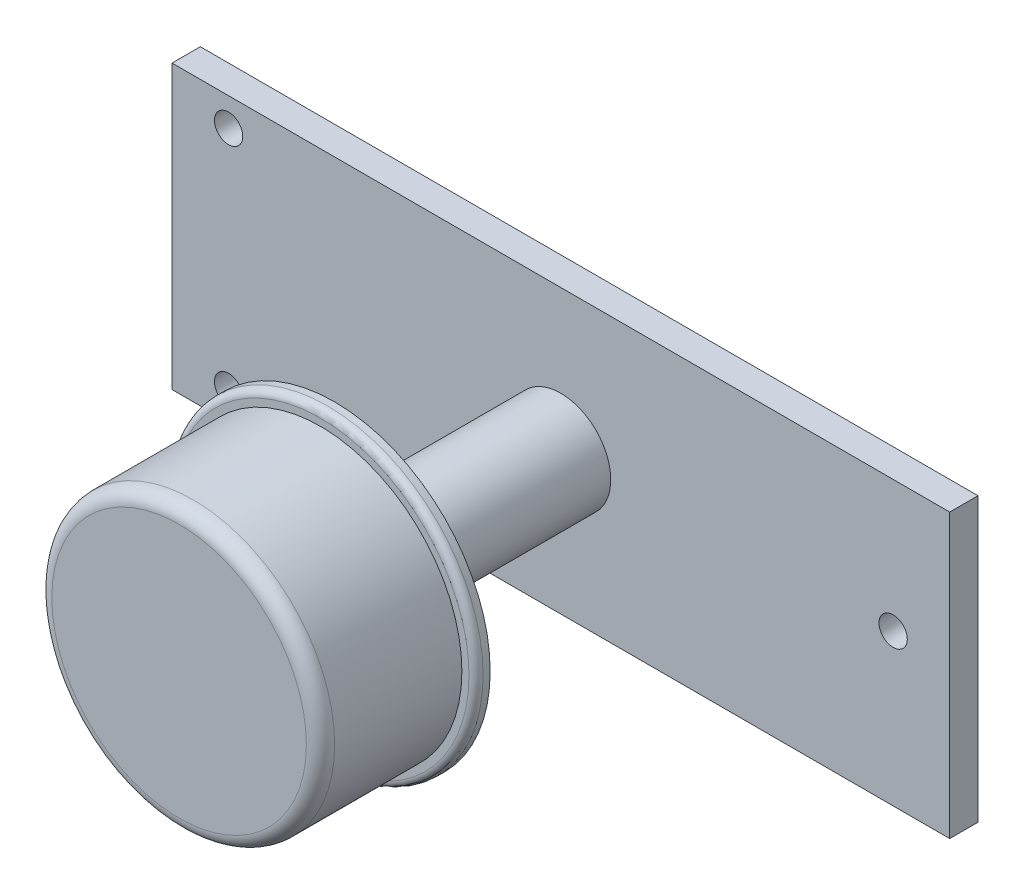
ISO-10303-21;
HEADER;
FILE_DESCRIPTION(('STEP AP214'),'2;1');
FILE_NAME('part.step','',(''),(''),'','','');
FILE_SCHEMA(('AUTOMOTIVE_DESIGN { 1 0 10303 214 1 1 1 1 }'));
ENDSEC;
DATA;
#1=APPLICATION_CONTEXT('core data for automotive mechanical design processes');
#2=APPLICATION_PROTOCOL_DEFINITION('international standard','automotive_design',2000,#1);
#3=PRODUCT_CONTEXT('',#1,'mechanical');
#4=PRODUCT('Part','Part','',(#3));
#5=PRODUCT_RELATED_PRODUCT_CATEGORY('part','',(#4));
#6=PRODUCT_DEFINITION_FORMATION('','',#4);
#7=PRODUCT_DEFINITION_CONTEXT('part definition',#1,'design');
#8=PRODUCT_DEFINITION('design','',#6,#7);
#9=PRODUCT_DEFINITION_SHAPE('','',#8);
#10=(LENGTH_UNIT() NAMED_UNIT(*) SI_UNIT(.MILLI.,.METRE.));
#11=(NAMED_UNIT(*) PLANE_ANGLE_UNIT() SI_UNIT($,.RADIAN.));
#12=(NAMED_UNIT(*) SI_UNIT($,.STERADIAN.) SOLID_ANGLE_UNIT());
#13=UNCERTAINTY_MEASURE_WITH_UNIT(LENGTH_MEASURE(1.E-05),#10,'distance_accuracy_value','');
#14=(GEOMETRIC_REPRESENTATION_CONTEXT(3) GLOBAL_UNCERTAINTY_ASSIGNED_CONTEXT((#13)) GLOBAL_UNIT_ASSIGNED_CONTEXT((#10,
#11,#12)) REPRESENTATION_CONTEXT('',''));
#15=CARTESIAN_POINT('',(0.,0.,0.));
#16=DIRECTION('',(0.,0.,1.));
#17=DIRECTION('',(1.,0.,0.));
#18=AXIS2_PLACEMENT_3D('',#15,#16,#17);
#19=CARTESIAN_POINT('',(0.,0.,2.));
#20=DIRECTION('',(0.,0.,-1.));
#21=DIRECTION('',(-1.,0.,0.));
#22=AXIS2_PLACEMENT_3D('',#19,#20,#21);
#23=PLANE('',#22);
#24=CARTESIAN_POINT('',(27.5,10.,2.));
#25=DIRECTION('',(0.,0.,-1.));
#26=DIRECTION('',(-1.,0.,0.));
#27=AXIS2_PLACEMENT_3D('',#24,#25,#26);
#28=CIRCLE('',#27,3.52662147856232);
#29=CARTESIAN_POINT('',(23.9733785214377,10.,2.));
#30=VERTEX_POINT('',#29);
#31=EDGE_CURVE('E120',#30,#30,#28,.F.);
#32=ORIENTED_EDGE('',*,*,#31,.F.);
#33=EDGE_LOOP('',(#32));
#34=FACE_BOUND('',#33,.T.);
#35=DIRECTION('',(0.,-1.,0.));
#36=VECTOR('',#35,1.);
#37=CARTESIAN_POINT('',(0.,0.,2.));
#38=LINE('',#37,#36);
#39=CARTESIAN_POINT('',(0.,20.,2.));
#40=VERTEX_POINT('',#39);
#41=CARTESIAN_POINT('',(0.,0.,2.));
#42=VERTEX_POINT('',#41);
#43=EDGE_CURVE('E95',#40,#42,#38,.T.);
#44=ORIENTED_EDGE('',*,*,#43,.T.);
#45=DIRECTION('',(1.,0.,0.));
#46=VECTOR('',#45,1.);
#47=CARTESIAN_POINT('',(0.,0.,2.));
#48=LINE('',#47,#46);
#49=CARTESIAN_POINT('',(55.,0.,2.));
#50=VERTEX_POINT('',#49);
#51=EDGE_CURVE('E87',#42,#50,#48,.T.);
#52=ORIENTED_EDGE('',*,*,#51,.T.);
#53=DIRECTION('',(0.,1.,0.));
#54=VECTOR('',#53,1.);
#55=CARTESIAN_POINT('',(55.,0.,2.));
#56=LINE('',#55,#54);
#57=CARTESIAN_POINT('',(55.,20.,2.));
#58=VERTEX_POINT('',#57);
#59=EDGE_CURVE('E89',#50,#58,#56,.T.);
#60=ORIENTED_EDGE('',*,*,#59,.T.);
#61=DIRECTION('',(-1.,0.,0.));
#62=VECTOR('',#61,1.);
#63=CARTESIAN_POINT('',(0.,20.,2.));
#64=LINE('',#63,#62);
#65=EDGE_CURVE('E57',#58,#40,#64,.T.);
#66=ORIENTED_EDGE('',*,*,#65,.T.);
#67=EDGE_LOOP('',(#44,#52,#60,#66));
#68=FACE_BOUND('',#67,.T.);
#69=CARTESIAN_POINT('',(4.,18.,2.));
#70=DIRECTION('',(0.,0.,1.));
#71=DIRECTION('',(1.,0.,0.));
#72=AXIS2_PLACEMENT_3D('',#69,#70,#71);
#73=CIRCLE('',#72,1.);
#74=CARTESIAN_POINT('',(5.,18.,2.));
#75=VERTEX_POINT('',#74);
#76=EDGE_CURVE('E109',#75,#75,#73,.T.);
#77=ORIENTED_EDGE('',*,*,#76,.F.);
#78=EDGE_LOOP('',(#77));
#79=FACE_BOUND('',#78,.T.);
#80=CARTESIAN_POINT('',(4.,2.,2.));
#81=DIRECTION('',(0.,0.,1.));
#82=DIRECTION('',(1.,0.,0.));
#83=AXIS2_PLACEMENT_3D('',#80,#81,#82);
#84=CIRCLE('',#83,1.);
#85=CARTESIAN_POINT('',(5.,2.,2.));
#86=VERTEX_POINT('',#85);
#87=EDGE_CURVE('E192',#86,#86,#84,.T.);
#88=ORIENTED_EDGE('',*,*,#87,.F.);
#89=EDGE_LOOP('',(#88));
#90=FACE_BOUND('',#89,.T.);
#91=CARTESIAN_POINT('',(51.,10.7109004739337,2.));
#92=DIRECTION('',(0.,0.,1.));
#93=DIRECTION('',(1.,0.,0.));
#94=AXIS2_PLACEMENT_3D('',#91,#92,#93);
#95=CIRCLE('',#94,0.999999999999998);
#96=CARTESIAN_POINT('',(52.,10.7109004739337,2.));
#97=VERTEX_POINT('',#96);
#98=EDGE_CURVE('E182',#97,#97,#95,.T.);
#99=ORIENTED_EDGE('',*,*,#98,.F.);
#100=EDGE_LOOP('',(#99));
#101=FACE_BOUND('',#100,.T.);
#102=ADVANCED_FACE('F39',(#34,#68,#79,#90,#101),#23,.F.);
#103=CARTESIAN_POINT('',(0.,0.,0.));
#104=DIRECTION('',(0.,0.,-1.));
#105=DIRECTION('',(-1.,0.,0.));
#106=AXIS2_PLACEMENT_3D('',#103,#104,#105);
#107=PLANE('',#106);
#108=CARTESIAN_POINT('',(4.,2.,0.));
#109=DIRECTION('',(0.,0.,1.));
#110=DIRECTION('',(1.,0.,0.));
#111=AXIS2_PLACEMENT_3D('',#108,#109,#110);
#112=CIRCLE('',#111,1.);
#113=CARTESIAN_POINT('',(5.,2.,0.));
#114=VERTEX_POINT('',#113);
#115=EDGE_CURVE('E183',#114,#114,#112,.T.);
#116=ORIENTED_EDGE('',*,*,#115,.T.);
#117=EDGE_LOOP('',(#116));
#118=FACE_BOUND('',#117,.T.);
#119=DIRECTION('',(0.,-1.,0.));
#120=VECTOR('',#119,1.);
#121=CARTESIAN_POINT('',(0.,0.,0.));
#122=LINE('',#121,#120);
#123=CARTESIAN_POINT('',(0.,20.,0.));
#124=VERTEX_POINT('',#123);
#125=CARTESIAN_POINT('',(0.,0.,0.));
#126=VERTEX_POINT('',#125);
#127=EDGE_CURVE('E110',#124,#126,#122,.T.);
#128=ORIENTED_EDGE('',*,*,#127,.F.);
#129=DIRECTION('',(-1.,0.,0.));
#130=VECTOR('',#129,1.);
#131=CARTESIAN_POINT('',(0.,20.,0.));
#132=LINE('',#131,#130);
#133=CARTESIAN_POINT('',(55.,20.,0.));
#134=VERTEX_POINT('',#133);
#135=EDGE_CURVE('E79',#134,#124,#132,.T.);
#136=ORIENTED_EDGE('',*,*,#135,.F.);
#137=DIRECTION('',(0.,1.,0.));
#138=VECTOR('',#137,1.);
#139=CARTESIAN_POINT('',(55.,0.,0.));
#140=LINE('',#139,#138);
#141=CARTESIAN_POINT('',(55.,0.,0.));
#142=VERTEX_POINT('',#141);
#143=EDGE_CURVE('E71',#142,#134,#140,.T.);
#144=ORIENTED_EDGE('',*,*,#143,.F.);
#145=DIRECTION('',(1.,0.,0.));
#146=VECTOR('',#145,1.);
#147=CARTESIAN_POINT('',(0.,0.,0.));
#148=LINE('',#147,#146);
#149=EDGE_CURVE('E100',#126,#142,#148,.T.);
#150=ORIENTED_EDGE('',*,*,#149,.F.);
#151=EDGE_LOOP('',(#128,#136,#144,#150));
#152=FACE_BOUND('',#151,.T.);
#153=CARTESIAN_POINT('',(4.,18.,0.));
#154=DIRECTION('',(0.,0.,1.));
#155=DIRECTION('',(1.,0.,0.));
#156=AXIS2_PLACEMENT_3D('',#153,#154,#155);
#157=CIRCLE('',#156,1.);
#158=CARTESIAN_POINT('',(5.,18.,0.));
#159=VERTEX_POINT('',#158);
#160=EDGE_CURVE('E177',#159,#159,#157,.T.);
#161=ORIENTED_EDGE('',*,*,#160,.T.);
#162=EDGE_LOOP('',(#161));
#163=FACE_BOUND('',#162,.T.);
#164=CARTESIAN_POINT('',(51.,10.7109004739337,0.));
#165=DIRECTION('',(0.,0.,1.));
#166=DIRECTION('',(1.,0.,0.));
#167=AXIS2_PLACEMENT_3D('',#164,#165,#166);
#168=CIRCLE('',#167,0.999999999999998);
#169=CARTESIAN_POINT('',(52.,10.7109004739337,0.));
#170=VERTEX_POINT('',#169);
#171=EDGE_CURVE('E176',#170,#170,#168,.T.);
#172=ORIENTED_EDGE('',*,*,#171,.T.);
#173=EDGE_LOOP('',(#172));
#174=FACE_BOUND('',#173,.T.);
#175=ADVANCED_FACE('F141',(#118,#152,#163,#174),#107,.T.);
#176=CARTESIAN_POINT('',(0.,0.,2.));
#177=DIRECTION('',(1.,0.,0.));
#178=DIRECTION('',(0.,0.,-1.));
#179=AXIS2_PLACEMENT_3D('',#176,#177,#178);
#180=PLANE('',#179);
#181=ORIENTED_EDGE('',*,*,#127,.T.);
#182=DIRECTION('',(0.,0.,-1.));
#183=VECTOR('',#182,1.);
#184=CARTESIAN_POINT('',(0.,0.,2.));
#185=LINE('',#184,#183);
#186=EDGE_CURVE('E98',#42,#126,#185,.T.);
#187=ORIENTED_EDGE('',*,*,#186,.F.);
#188=ORIENTED_EDGE('',*,*,#43,.F.);
#189=DIRECTION('',(0.,0.,-1.));
#190=VECTOR('',#189,1.);
#191=CARTESIAN_POINT('',(0.,20.,2.));
#192=LINE('',#191,#190);
#193=EDGE_CURVE('E103',#40,#124,#192,.T.);
#194=ORIENTED_EDGE('',*,*,#193,.T.);
#195=EDGE_LOOP('',(#181,#187,#188,#194));
#196=FACE_BOUND('',#195,.T.);
#197=ADVANCED_FACE('F151',(#196),#180,.F.);
#198=CARTESIAN_POINT('',(0.,0.,2.));
#199=DIRECTION('',(0.,1.,0.));
#200=DIRECTION('',(0.,0.,1.));
#201=AXIS2_PLACEMENT_3D('',#198,#199,#200);
#202=PLANE('',#201);
#203=ORIENTED_EDGE('',*,*,#149,.T.);
#204=DIRECTION('',(0.,0.,-1.));
#205=VECTOR('',#204,1.);
#206=CARTESIAN_POINT('',(55.,0.,2.));
#207=LINE('',#206,#205);
#208=EDGE_CURVE('E92',#50,#142,#207,.T.);
#209=ORIENTED_EDGE('',*,*,#208,.F.);
#210=ORIENTED_EDGE('',*,*,#51,.F.);
#211=ORIENTED_EDGE('',*,*,#186,.T.);
#212=EDGE_LOOP('',(#203,#209,#210,#211));
#213=FACE_BOUND('',#212,.T.);
#214=ADVANCED_FACE('F96',(#213),#202,.F.);
#215=CARTESIAN_POINT('',(55.,0.,2.));
#216=DIRECTION('',(-1.,0.,0.));
#217=DIRECTION('',(0.,0.,1.));
#218=AXIS2_PLACEMENT_3D('',#215,#216,#217);
#219=PLANE('',#218);
#220=ORIENTED_EDGE('',*,*,#143,.T.);
#221=DIRECTION('',(0.,0.,-1.));
#222=VECTOR('',#221,1.);
#223=CARTESIAN_POINT('',(55.,20.,2.));
#224=LINE('',#223,#222);
#225=EDGE_CURVE('E97',#58,#134,#224,.T.);
#226=ORIENTED_EDGE('',*,*,#225,.F.);
#227=ORIENTED_EDGE('',*,*,#59,.F.);
#228=ORIENTED_EDGE('',*,*,#208,.T.);
#229=EDGE_LOOP('',(#220,#226,#227,#228));
#230=FACE_BOUND('',#229,.T.);
#231=ADVANCED_FACE('F101',(#230),#219,.F.);
#232=CARTESIAN_POINT('',(0.,20.,2.));
#233=DIRECTION('',(0.,-1.,0.));
#234=DIRECTION('',(0.,0.,-1.));
#235=AXIS2_PLACEMENT_3D('',#232,#233,#234);
#236=PLANE('',#235);
#237=ORIENTED_EDGE('',*,*,#135,.T.);
#238=ORIENTED_EDGE('',*,*,#193,.F.);
#239=ORIENTED_EDGE('',*,*,#65,.F.);
#240=ORIENTED_EDGE('',*,*,#225,.T.);
#241=EDGE_LOOP('',(#237,#238,#239,#240));
#242=FACE_BOUND('',#241,.T.);
#243=ADVANCED_FACE('F157',(#242),#236,.F.);
#244=CARTESIAN_POINT('',(4.,18.,2.));
#245=DIRECTION('',(0.,0.,-1.));
#246=DIRECTION('',(-1.,0.,0.));
#247=AXIS2_PLACEMENT_3D('',#244,#245,#246);
#248=CYLINDRICAL_SURFACE('',#247,1.);
#249=ORIENTED_EDGE('',*,*,#76,.T.);
#250=EDGE_LOOP('',(#249));
#251=FACE_BOUND('',#250,.T.);
#252=ORIENTED_EDGE('',*,*,#160,.F.);
#253=EDGE_LOOP('',(#252));
#254=FACE_BOUND('',#253,.T.);
#255=ADVANCED_FACE('F156',(#251,#254),#248,.F.);
#256=CARTESIAN_POINT('',(4.,2.,2.));
#257=DIRECTION('',(0.,0.,-1.));
#258=DIRECTION('',(-1.,0.,0.));
#259=AXIS2_PLACEMENT_3D('',#256,#257,#258);
#260=CYLINDRICAL_SURFACE('',#259,1.);
#261=ORIENTED_EDGE('',*,*,#87,.T.);
#262=EDGE_LOOP('',(#261));
#263=FACE_BOUND('',#262,.T.);
#264=ORIENTED_EDGE('',*,*,#115,.F.);
#265=EDGE_LOOP('',(#264));
#266=FACE_BOUND('',#265,.T.);
#267=ADVANCED_FACE('F208',(#263,#266),#260,.F.);
#268=CARTESIAN_POINT('',(51.,10.7109004739337,2.));
#269=DIRECTION('',(0.,0.,-1.));
#270=DIRECTION('',(-1.,0.,0.));
#271=AXIS2_PLACEMENT_3D('',#268,#269,#270);
#272=CYLINDRICAL_SURFACE('',#271,0.999999999999998);
#273=ORIENTED_EDGE('',*,*,#98,.T.);
#274=EDGE_LOOP('',(#273));
#275=FACE_BOUND('',#274,.T.);
#276=ORIENTED_EDGE('',*,*,#171,.F.);
#277=EDGE_LOOP('',(#276));
#278=FACE_BOUND('',#277,.T.);
#279=ADVANCED_FACE('F206',(#275,#278),#272,.F.);
#280=CARTESIAN_POINT('',(27.5,10.,18.));
#281=DIRECTION('',(0.,0.,-1.));
#282=DIRECTION('',(-1.,0.,0.));
#283=AXIS2_PLACEMENT_3D('',#280,#281,#282);
#284=CYLINDRICAL_SURFACE('',#283,3.52662147856232);
#285=CARTESIAN_POINT('',(27.5,10.,18.));
#286=DIRECTION('',(0.,0.,1.));
#287=DIRECTION('',(1.,0.,0.));
#288=AXIS2_PLACEMENT_3D('',#285,#286,#287);
#289=CIRCLE('',#288,3.52662147856232);
#290=CARTESIAN_POINT('',(31.0266214785623,10.,18.));
#291=VERTEX_POINT('',#290);
#292=EDGE_CURVE('E185',#291,#291,#289,.T.);
#293=ORIENTED_EDGE('',*,*,#292,.F.);
#294=EDGE_LOOP('',(#293));
#295=FACE_BOUND('',#294,.T.);
#296=ORIENTED_EDGE('',*,*,#31,.T.);
#297=EDGE_LOOP('',(#296));
#298=FACE_BOUND('',#297,.T.);
#299=ADVANCED_FACE('F210',(#295,#298),#284,.T.);
#300=CARTESIAN_POINT('',(27.5,10.,19.));
#301=DIRECTION('',(0.,0.,-1.));
#302=DIRECTION('',(-1.,0.,0.));
#303=AXIS2_PLACEMENT_3D('',#300,#301,#302);
#304=CYLINDRICAL_SURFACE('',#303,11.);
#305=CARTESIAN_POINT('',(27.5,10.,18.5));
#306=DIRECTION('',(0.,0.,1.));
#307=DIRECTION('',(1.,0.,0.));
#308=AXIS2_PLACEMENT_3D('',#305,#306,#307);
#309=CIRCLE('',#308,11.);
#310=CARTESIAN_POINT('',(38.5,10.,18.5));
#311=VERTEX_POINT('',#310);
#312=EDGE_CURVE('E11',#311,#311,#309,.F.);
#313=ORIENTED_EDGE('',*,*,#312,.T.);
#314=EDGE_LOOP('',(#313));
#315=FACE_BOUND('',#314,.T.);
#316=CARTESIAN_POINT('',(27.5,10.,18.));
#317=DIRECTION('',(0.,0.,1.));
#318=DIRECTION('',(1.,0.,0.));
#319=AXIS2_PLACEMENT_3D('',#316,#317,#318);
#320=CIRCLE('',#319,11.);
#321=CARTESIAN_POINT('',(38.5,10.,18.));
#322=VERTEX_POINT('',#321);
#323=EDGE_CURVE('E186',#322,#322,#320,.T.);
#324=ORIENTED_EDGE('',*,*,#323,.T.);
#325=EDGE_LOOP('',(#324));
#326=FACE_BOUND('',#325,.T.);
#327=ADVANCED_FACE('F213',(#315,#326),#304,.T.);
#328=CARTESIAN_POINT('',(27.5,10.,19.));
#329=DIRECTION('',(0.,0.,1.));
#330=DIRECTION('',(1.,0.,0.));
#331=AXIS2_PLACEMENT_3D('',#328,#329,#330);
#332=PLANE('',#331);
#333=CARTESIAN_POINT('',(27.5,10.,19.));
#334=DIRECTION('',(0.,0.,1.));
#335=DIRECTION('',(1.,0.,0.));
#336=AXIS2_PLACEMENT_3D('',#333,#334,#335);
#337=CIRCLE('',#336,10.5);
#338=CARTESIAN_POINT('',(38.,10.,19.));
#339=VERTEX_POINT('',#338);
#340=EDGE_CURVE('E48',#339,#339,#337,.T.);
#341=ORIENTED_EDGE('',*,*,#340,.T.);
#342=EDGE_LOOP('',(#341));
#343=FACE_BOUND('',#342,.T.);
#344=CARTESIAN_POINT('',(27.5,10.,19.));
#345=DIRECTION('',(0.,0.,1.));
#346=DIRECTION('',(1.,0.,0.));
#347=AXIS2_PLACEMENT_3D('',#344,#345,#346);
#348=CIRCLE('',#347,10.);
#349=CARTESIAN_POINT('',(37.5,10.,19.));
#350=VERTEX_POINT('',#349);
#351=EDGE_CURVE('E117',#350,#350,#348,.T.);
#352=ORIENTED_EDGE('',*,*,#351,.F.);
#353=EDGE_LOOP('',(#352));
#354=FACE_BOUND('',#353,.T.);
#355=ADVANCED_FACE('F129',(#343,#354),#332,.T.);
#356=CARTESIAN_POINT('',(27.5,10.,18.));
#357=DIRECTION('',(0.,0.,1.));
#358=DIRECTION('',(1.,0.,0.));
#359=AXIS2_PLACEMENT_3D('',#356,#357,#358);
#360=PLANE('',#359);
#361=ORIENTED_EDGE('',*,*,#292,.T.);
#362=EDGE_LOOP('',(#361));
#363=FACE_BOUND('',#362,.T.);
#364=ORIENTED_EDGE('',*,*,#323,.F.);
#365=EDGE_LOOP('',(#364));
#366=FACE_BOUND('',#365,.T.);
#367=ADVANCED_FACE('F222',(#363,#366),#360,.F.);
#368=CARTESIAN_POINT('',(27.5,10.,29.));
#369=DIRECTION('',(0.,0.,-1.));
#370=DIRECTION('',(-1.,0.,0.));
#371=AXIS2_PLACEMENT_3D('',#368,#369,#370);
#372=CYLINDRICAL_SURFACE('',#371,10.);
#373=CARTESIAN_POINT('',(27.5,10.,28.));
#374=DIRECTION('',(0.,0.,1.));
#375=DIRECTION('',(1.,0.,0.));
#376=AXIS2_PLACEMENT_3D('',#373,#374,#375);
#377=CIRCLE('',#376,10.);
#378=CARTESIAN_POINT('',(37.5,10.,28.));
#379=VERTEX_POINT('',#378);
#380=EDGE_CURVE('E121',#379,#379,#377,.F.);
#381=ORIENTED_EDGE('',*,*,#380,.T.);
#382=EDGE_LOOP('',(#381));
#383=FACE_BOUND('',#382,.T.);
#384=ORIENTED_EDGE('',*,*,#351,.T.);
#385=EDGE_LOOP('',(#384));
#386=FACE_BOUND('',#385,.T.);
#387=ADVANCED_FACE('F221',(#383,#386),#372,.T.);
#388=CARTESIAN_POINT('',(27.5,10.,29.));
#389=DIRECTION('',(0.,0.,1.));
#390=DIRECTION('',(1.,0.,0.));
#391=AXIS2_PLACEMENT_3D('',#388,#389,#390);
#392=PLANE('',#391);
#393=CARTESIAN_POINT('',(27.5,10.,29.));
#394=DIRECTION('',(0.,0.,1.));
#395=DIRECTION('',(1.,0.,0.));
#396=AXIS2_PLACEMENT_3D('',#393,#394,#395);
#397=CIRCLE('',#396,9.);
#398=CARTESIAN_POINT('',(36.5,10.,29.));
#399=VERTEX_POINT('',#398);
#400=EDGE_CURVE('E122',#399,#399,#397,.T.);
#401=ORIENTED_EDGE('',*,*,#400,.T.);
#402=EDGE_LOOP('',(#401));
#403=FACE_BOUND('',#402,.T.);
#404=ADVANCED_FACE('F136',(#403),#392,.T.);
#405=CARTESIAN_POINT('',(27.5,10.,28.));
#406=DIRECTION('',(0.,0.,1.));
#407=DIRECTION('',(1.,0.,0.));
#408=AXIS2_PLACEMENT_3D('',#405,#406,#407);
#409=TOROIDAL_SURFACE('',#408,9.,1.);
#410=ORIENTED_EDGE('',*,*,#380,.F.);
#411=EDGE_LOOP('',(#410));
#412=FACE_BOUND('',#411,.T.);
#413=ORIENTED_EDGE('',*,*,#400,.F.);
#414=EDGE_LOOP('',(#413));
#415=FACE_BOUND('',#414,.T.);
#416=ADVANCED_FACE('F131',(#412,#415),#409,.T.);
#417=CARTESIAN_POINT('',(27.5,10.,18.5));
#418=DIRECTION('',(0.,0.,1.));
#419=DIRECTION('',(1.,0.,0.));
#420=AXIS2_PLACEMENT_3D('',#417,#418,#419);
#421=TOROIDAL_SURFACE('',#420,10.5,0.5);
#422=ORIENTED_EDGE('',*,*,#312,.F.);
#423=EDGE_LOOP('',(#422));
#424=FACE_BOUND('',#423,.T.);
#425=ORIENTED_EDGE('',*,*,#340,.F.);
#426=EDGE_LOOP('',(#425));
#427=FACE_BOUND('',#426,.T.);
#428=ADVANCED_FACE('F41',(#424,#427),#421,.T.);
#429=CLOSED_SHELL('',(#102,#175,#197,#214,#231,#243,#255,#267,#279,#299,#327,#355,#367,#387,
#404,#416,#428));
#430=MANIFOLD_SOLID_BREP('B2',#429);
#431=ADVANCED_BREP_SHAPE_REPRESENTATION('',(#18,#430),#14);
#432=SHAPE_DEFINITION_REPRESENTATION(#9,#431);
ENDSEC;
END-ISO-10303-21;
